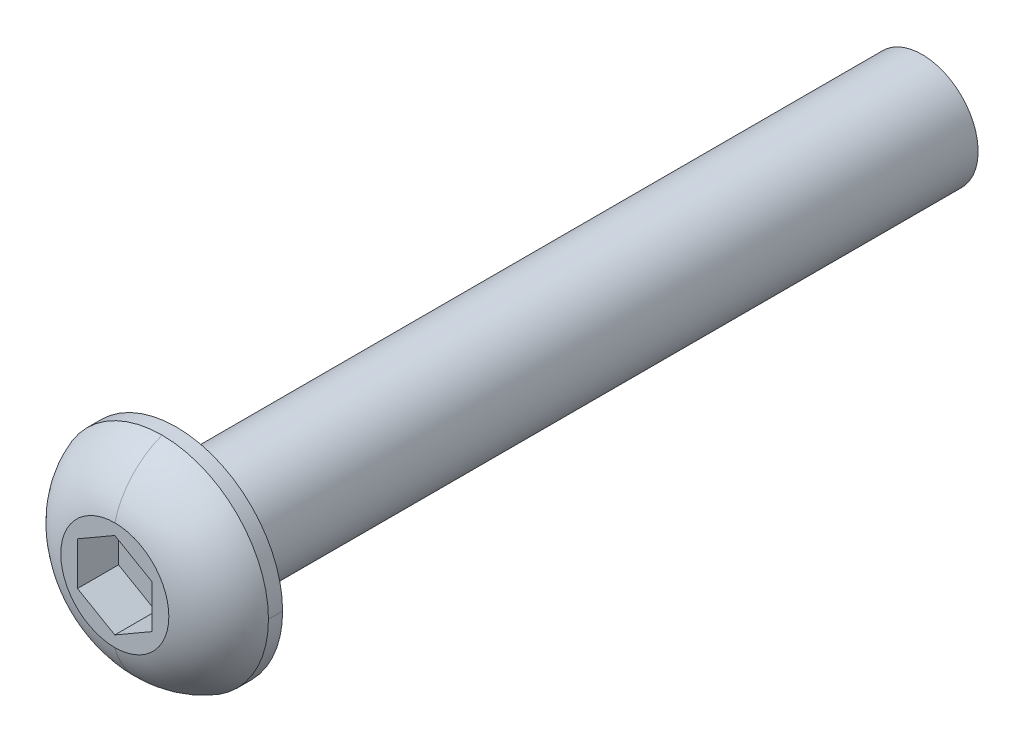
ISO-10303-21;
HEADER;
FILE_DESCRIPTION(('STEP AP214'),'2;1');
FILE_NAME('part.step','',(''),(''),'','','');
FILE_SCHEMA(('AUTOMOTIVE_DESIGN { 1 0 10303 214 1 1 1 1 }'));
ENDSEC;
DATA;
#1=APPLICATION_CONTEXT('core data for automotive mechanical design processes');
#2=APPLICATION_PROTOCOL_DEFINITION('international standard','automotive_design',2000,#1);
#3=PRODUCT_CONTEXT('',#1,'mechanical');
#4=PRODUCT('Part','Part','',(#3));
#5=PRODUCT_RELATED_PRODUCT_CATEGORY('part','',(#4));
#6=PRODUCT_DEFINITION_FORMATION('','',#4);
#7=PRODUCT_DEFINITION_CONTEXT('part definition',#1,'design');
#8=PRODUCT_DEFINITION('design','',#6,#7);
#9=PRODUCT_DEFINITION_SHAPE('','',#8);
#10=(LENGTH_UNIT() NAMED_UNIT(*) SI_UNIT(.MILLI.,.METRE.));
#11=(NAMED_UNIT(*) PLANE_ANGLE_UNIT() SI_UNIT($,.RADIAN.));
#12=(NAMED_UNIT(*) SI_UNIT($,.STERADIAN.) SOLID_ANGLE_UNIT());
#13=UNCERTAINTY_MEASURE_WITH_UNIT(LENGTH_MEASURE(1.E-05),#10,'distance_accuracy_value','');
#14=(GEOMETRIC_REPRESENTATION_CONTEXT(3) GLOBAL_UNCERTAINTY_ASSIGNED_CONTEXT((#13)) GLOBAL_UNIT_ASSIGNED_CONTEXT((#10,
#11,#12)) REPRESENTATION_CONTEXT('',''));
#15=CARTESIAN_POINT('',(0.,0.,0.));
#16=DIRECTION('',(0.,0.,1.));
#17=DIRECTION('',(1.,0.,0.));
#18=AXIS2_PLACEMENT_3D('',#15,#16,#17);
#19=CARTESIAN_POINT('',(0.,0.,0.190000000005322));
#20=DIRECTION('',(0.,0.,-1.));
#21=DIRECTION('',(-1.,0.,0.));
#22=AXIS2_PLACEMENT_3D('',#19,#20,#21);
#23=CYLINDRICAL_SURFACE('',#22,2.84999999998889);
#24=DIRECTION('',(0.,0.,-1.));
#25=VECTOR('',#24,1.);
#26=CARTESIAN_POINT('',(-2.84999999998889,0.,0.190000000005321));
#27=LINE('',#26,#25);
#28=CARTESIAN_POINT('',(-2.84999999997778,0.,0.380000000010643));
#29=VERTEX_POINT('',#28);
#30=CARTESIAN_POINT('',(-2.85,0.,0.));
#31=VERTEX_POINT('',#30);
#32=EDGE_CURVE('E200',#29,#31,#27,.T.);
#33=ORIENTED_EDGE('',*,*,#32,.F.);
#34=CARTESIAN_POINT('',(0.,0.,0.380000000010643));
#35=DIRECTION('',(0.,0.,-1.));
#36=DIRECTION('',(-1.,0.,0.));
#37=AXIS2_PLACEMENT_3D('',#34,#35,#36);
#38=CIRCLE('',#37,2.84999999997778);
#39=CARTESIAN_POINT('',(0.,2.84999999997778,0.380000000010643));
#40=VERTEX_POINT('',#39);
#41=EDGE_CURVE('E11',#29,#40,#38,.T.);
#42=ORIENTED_EDGE('',*,*,#41,.T.);
#43=CARTESIAN_POINT('',(0.,0.,0.380000000010643));
#44=DIRECTION('',(0.,0.,-1.));
#45=DIRECTION('',(-1.,0.,0.));
#46=AXIS2_PLACEMENT_3D('',#43,#44,#45);
#47=CIRCLE('',#46,2.84999999997778);
#48=CARTESIAN_POINT('',(2.84999999997778,0.,0.380000000010643));
#49=VERTEX_POINT('',#48);
#50=EDGE_CURVE('E43',#40,#49,#47,.T.);
#51=ORIENTED_EDGE('',*,*,#50,.T.);
#52=DIRECTION('',(0.,0.,1.));
#53=VECTOR('',#52,1.);
#54=CARTESIAN_POINT('',(2.84999999998889,0.,0.190000000005322));
#55=LINE('',#54,#53);
#56=CARTESIAN_POINT('',(2.85,0.,0.));
#57=VERTEX_POINT('',#56);
#58=EDGE_CURVE('E195',#57,#49,#55,.T.);
#59=ORIENTED_EDGE('',*,*,#58,.F.);
#60=CARTESIAN_POINT('',(0.,0.,0.));
#61=DIRECTION('',(0.,0.,-1.));
#62=DIRECTION('',(-1.,0.,0.));
#63=AXIS2_PLACEMENT_3D('',#60,#61,#62);
#64=CIRCLE('',#63,2.85);
#65=EDGE_CURVE('E191',#31,#57,#64,.T.);
#66=ORIENTED_EDGE('',*,*,#65,.F.);
#67=EDGE_LOOP('',(#33,#42,#51,#59,#66));
#68=FACE_BOUND('',#67,.T.);
#69=ADVANCED_FACE('F34',(#68),#23,.T.);
#70=CARTESIAN_POINT('',(0.,0.,-0.313131109201524));
#71=DIRECTION('',(0.,0.,-1.));
#72=DIRECTION('',(0.,-1.,0.));
#73=AXIS2_PLACEMENT_3D('',#70,#71,#72);
#74=DEGENERATE_TOROIDAL_SURFACE('',#73,0.945637928697733,2.02657978700265,.T.);
#75=CARTESIAN_POINT('',(0.,-0.945637928697733,-0.313131109201524));
#76=DIRECTION('',(1.,0.,0.));
#77=DIRECTION('',(0.,-1.,0.));
#78=AXIS2_PLACEMENT_3D('',#75,#76,#77);
#79=CIRCLE('',#78,2.02657978700265);
#80=CARTESIAN_POINT('',(0.,-1.44877,1.65));
#81=VERTEX_POINT('',#80);
#82=CARTESIAN_POINT('',(0.,-2.84999999997778,0.380000000010643));
#83=VERTEX_POINT('',#82);
#84=EDGE_CURVE('E169',#81,#83,#79,.T.);
#85=ORIENTED_EDGE('',*,*,#84,.F.);
#86=CARTESIAN_POINT('',(0.,0.,1.65));
#87=DIRECTION('',(0.,0.,-1.));
#88=DIRECTION('',(-1.,0.,0.));
#89=AXIS2_PLACEMENT_3D('',#86,#87,#88);
#90=CIRCLE('',#89,1.44877);
#91=CARTESIAN_POINT('',(-1.44877,0.,1.65));
#92=VERTEX_POINT('',#91);
#93=EDGE_CURVE('E184',#81,#92,#90,.T.);
#94=ORIENTED_EDGE('',*,*,#93,.T.);
#95=CARTESIAN_POINT('',(0.,0.,1.65));
#96=DIRECTION('',(0.,0.,-1.));
#97=DIRECTION('',(-1.,0.,0.));
#98=AXIS2_PLACEMENT_3D('',#95,#96,#97);
#99=CIRCLE('',#98,1.44877);
#100=CARTESIAN_POINT('',(0.,1.44877,1.65));
#101=VERTEX_POINT('',#100);
#102=EDGE_CURVE('E151',#92,#101,#99,.T.);
#103=ORIENTED_EDGE('',*,*,#102,.T.);
#104=CARTESIAN_POINT('',(0.,0.945637928697733,-0.313131109201524));
#105=DIRECTION('',(1.,0.,0.));
#106=DIRECTION('',(0.,1.,0.));
#107=AXIS2_PLACEMENT_3D('',#104,#105,#106);
#108=CIRCLE('',#107,2.02657978700265);
#109=EDGE_CURVE('E199',#40,#101,#108,.T.);
#110=ORIENTED_EDGE('',*,*,#109,.F.);
#111=ORIENTED_EDGE('',*,*,#41,.F.);
#112=CARTESIAN_POINT('',(0.,0.,0.380000000010643));
#113=DIRECTION('',(0.,0.,-1.));
#114=DIRECTION('',(-1.,0.,0.));
#115=AXIS2_PLACEMENT_3D('',#112,#113,#114);
#116=CIRCLE('',#115,2.84999999997778);
#117=EDGE_CURVE('E196',#83,#29,#116,.T.);
#118=ORIENTED_EDGE('',*,*,#117,.F.);
#119=EDGE_LOOP('',(#85,#94,#103,#110,#111,#118));
#120=FACE_BOUND('',#119,.T.);
#121=ADVANCED_FACE('F277',(#120),#74,.T.);
#122=CARTESIAN_POINT('',(0.,0.,-3.89665));
#123=DIRECTION('',(0.,0.,-1.));
#124=DIRECTION('',(-1.,0.,0.));
#125=AXIS2_PLACEMENT_3D('',#122,#123,#124);
#126=CYLINDRICAL_SURFACE('',#125,1.5);
#127=DIRECTION('',(0.,0.,1.));
#128=VECTOR('',#127,1.);
#129=CARTESIAN_POINT('',(1.5,0.,-3.89665));
#130=LINE('',#129,#128);
#131=CARTESIAN_POINT('',(1.5,0.,-7.));
#132=VERTEX_POINT('',#131);
#133=CARTESIAN_POINT('',(1.5,0.,-0.1));
#134=VERTEX_POINT('',#133);
#135=EDGE_CURVE('E50',#132,#134,#130,.T.);
#136=ORIENTED_EDGE('',*,*,#135,.F.);
#137=ORIENTED_EDGE('',*,*,#135,.T.);
#138=CARTESIAN_POINT('',(0.,0.,-0.1));
#139=DIRECTION('',(0.,0.,-1.));
#140=DIRECTION('',(-1.,0.,0.));
#141=AXIS2_PLACEMENT_3D('',#138,#139,#140);
#142=CIRCLE('',#141,1.5);
#143=CARTESIAN_POINT('',(0.,-1.5,-0.1));
#144=VERTEX_POINT('',#143);
#145=EDGE_CURVE('E154',#134,#144,#142,.T.);
#146=ORIENTED_EDGE('',*,*,#145,.T.);
#147=CARTESIAN_POINT('',(0.,0.,-0.1));
#148=DIRECTION('',(0.,0.,-1.));
#149=DIRECTION('',(-1.,0.,0.));
#150=AXIS2_PLACEMENT_3D('',#147,#148,#149);
#151=CIRCLE('',#150,1.5);
#152=CARTESIAN_POINT('',(-1.5,0.,-0.1));
#153=VERTEX_POINT('',#152);
#154=EDGE_CURVE('E148',#144,#153,#151,.T.);
#155=ORIENTED_EDGE('',*,*,#154,.T.);
#156=DIRECTION('',(0.,0.,-1.));
#157=VECTOR('',#156,1.);
#158=CARTESIAN_POINT('',(-1.5,0.,-3.89665));
#159=LINE('',#158,#157);
#160=CARTESIAN_POINT('',(-1.5,0.,-7.));
#161=VERTEX_POINT('',#160);
#162=EDGE_CURVE('E55',#153,#161,#159,.T.);
#163=ORIENTED_EDGE('',*,*,#162,.T.);
#164=ORIENTED_EDGE('',*,*,#162,.F.);
#165=CARTESIAN_POINT('',(0.,0.,-0.1));
#166=DIRECTION('',(0.,0.,-1.));
#167=DIRECTION('',(-1.,0.,0.));
#168=AXIS2_PLACEMENT_3D('',#165,#166,#167);
#169=CIRCLE('',#168,1.5);
#170=CARTESIAN_POINT('',(0.,1.5,-0.1));
#171=VERTEX_POINT('',#170);
#172=EDGE_CURVE('E141',#153,#171,#169,.T.);
#173=ORIENTED_EDGE('',*,*,#172,.T.);
#174=CARTESIAN_POINT('',(0.,0.,-0.1));
#175=DIRECTION('',(0.,0.,-1.));
#176=DIRECTION('',(-1.,0.,0.));
#177=AXIS2_PLACEMENT_3D('',#174,#175,#176);
#178=CIRCLE('',#177,1.5);
#179=EDGE_CURVE('E38',#171,#134,#178,.T.);
#180=ORIENTED_EDGE('',*,*,#179,.T.);
#181=EDGE_LOOP('',(#136,#137,#146,#155,#163,#164,#173,#180));
#182=FACE_BOUND('',#181,.T.);
#183=CARTESIAN_POINT('',(0.,0.,-20.));
#184=DIRECTION('',(0.,0.,-1.));
#185=DIRECTION('',(-1.,0.,0.));
#186=AXIS2_PLACEMENT_3D('',#183,#184,#185);
#187=CIRCLE('',#186,1.5);
#188=CARTESIAN_POINT('',(-1.5,0.,-20.));
#189=VERTEX_POINT('',#188);
#190=EDGE_CURVE('E230',#189,#189,#187,.T.);
#191=ORIENTED_EDGE('',*,*,#190,.F.);
#192=EDGE_LOOP('',(#191));
#193=FACE_BOUND('',#192,.T.);
#194=ADVANCED_FACE('F139',(#182,#193),#126,.T.);
#195=CARTESIAN_POINT('',(0.,0.,-0.1));
#196=DIRECTION('',(0.,0.,-1.));
#197=DIRECTION('',(0.,-1.,0.));
#198=AXIS2_PLACEMENT_3D('',#195,#196,#197);
#199=TOROIDAL_SURFACE('',#198,1.6,0.1);
#200=CARTESIAN_POINT('',(0.,1.6,-0.1));
#201=DIRECTION('',(1.,0.,0.));
#202=DIRECTION('',(0.,1.,0.));
#203=AXIS2_PLACEMENT_3D('',#200,#201,#202);
#204=CIRCLE('',#203,0.1);
#205=CARTESIAN_POINT('',(0.,1.6,0.));
#206=VERTEX_POINT('',#205);
#207=EDGE_CURVE('E150',#206,#171,#204,.T.);
#208=ORIENTED_EDGE('',*,*,#207,.F.);
#209=CARTESIAN_POINT('',(0.,0.,0.));
#210=DIRECTION('',(0.,0.,-1.));
#211=DIRECTION('',(-1.,0.,0.));
#212=AXIS2_PLACEMENT_3D('',#209,#210,#211);
#213=CIRCLE('',#212,1.6);
#214=CARTESIAN_POINT('',(0.,-1.6,0.));
#215=VERTEX_POINT('',#214);
#216=EDGE_CURVE('E235',#206,#215,#213,.T.);
#217=ORIENTED_EDGE('',*,*,#216,.T.);
#218=CARTESIAN_POINT('',(0.,-1.6,-0.1));
#219=DIRECTION('',(1.,0.,0.));
#220=DIRECTION('',(0.,-1.,0.));
#221=AXIS2_PLACEMENT_3D('',#218,#219,#220);
#222=CIRCLE('',#221,0.1);
#223=EDGE_CURVE('E224',#144,#215,#222,.T.);
#224=ORIENTED_EDGE('',*,*,#223,.F.);
#225=ORIENTED_EDGE('',*,*,#145,.F.);
#226=ORIENTED_EDGE('',*,*,#179,.F.);
#227=EDGE_LOOP('',(#208,#217,#224,#225,#226));
#228=FACE_BOUND('',#227,.T.);
#229=ADVANCED_FACE('F276',(#228),#199,.F.);
#230=CARTESIAN_POINT('',(1.,0.2886751346,1.65));
#231=DIRECTION('',(1.,0.,0.));
#232=DIRECTION('',(0.,1.,0.));
#233=AXIS2_PLACEMENT_3D('',#230,#231,#232);
#234=PLANE('',#233);
#235=DIRECTION('',(0.,1.,0.));
#236=VECTOR('',#235,1.);
#237=CARTESIAN_POINT('',(1.,0.,0.55));
#238=LINE('',#237,#236);
#239=CARTESIAN_POINT('',(1.,-0.5773502692,0.55));
#240=VERTEX_POINT('',#239);
#241=CARTESIAN_POINT('',(1.,0.5773502692,0.55));
#242=VERTEX_POINT('',#241);
#243=EDGE_CURVE('E172',#240,#242,#238,.T.);
#244=ORIENTED_EDGE('',*,*,#243,.F.);
#245=DIRECTION('',(0.,0.,-1.));
#246=VECTOR('',#245,1.);
#247=CARTESIAN_POINT('',(1.,-0.5773502692,1.65));
#248=LINE('',#247,#246);
#249=CARTESIAN_POINT('',(1.,-0.5773502692,1.65));
#250=VERTEX_POINT('',#249);
#251=EDGE_CURVE('E181',#250,#240,#248,.T.);
#252=ORIENTED_EDGE('',*,*,#251,.F.);
#253=DIRECTION('',(0.,-1.,0.));
#254=VECTOR('',#253,1.);
#255=CARTESIAN_POINT('',(1.,0.1443375673,1.65));
#256=LINE('',#255,#254);
#257=CARTESIAN_POINT('',(1.,0.5773502692,1.65));
#258=VERTEX_POINT('',#257);
#259=EDGE_CURVE('E156',#258,#250,#256,.T.);
#260=ORIENTED_EDGE('',*,*,#259,.F.);
#261=DIRECTION('',(0.,0.,-1.));
#262=VECTOR('',#261,1.);
#263=CARTESIAN_POINT('',(1.,0.5773502692,1.65));
#264=LINE('',#263,#262);
#265=EDGE_CURVE('E232',#258,#242,#264,.T.);
#266=ORIENTED_EDGE('',*,*,#265,.T.);
#267=EDGE_LOOP('',(#244,#252,#260,#266));
#268=FACE_BOUND('',#267,.T.);
#269=ADVANCED_FACE('F36',(#268),#234,.F.);
#270=CARTESIAN_POINT('',(0.5,0.8660254038,1.65));
#271=DIRECTION('',(0.500000000006738,0.866025403780548,0.));
#272=DIRECTION('',(0.,0.,-1.));
#273=AXIS2_PLACEMENT_3D('',#270,#271,#272);
#274=PLANE('',#273);
#275=DIRECTION('',(-0.866025403780548,0.500000000006738,0.));
#276=VECTOR('',#275,1.);
#277=CARTESIAN_POINT('',(0.,1.1547005384,0.55));
#278=LINE('',#277,#276);
#279=CARTESIAN_POINT('',(0.,1.1547005384,0.55));
#280=VERTEX_POINT('',#279);
#281=EDGE_CURVE('E170',#242,#280,#278,.T.);
#282=ORIENTED_EDGE('',*,*,#281,.F.);
#283=ORIENTED_EDGE('',*,*,#265,.F.);
#284=DIRECTION('',(0.866025403780548,-0.500000000006738,0.));
#285=VECTOR('',#284,1.);
#286=CARTESIAN_POINT('',(0.0127306250111162,1.14735050862275,1.65));
#287=LINE('',#286,#285);
#288=CARTESIAN_POINT('',(0.,1.1547005384,1.65));
#289=VERTEX_POINT('',#288);
#290=EDGE_CURVE('E165',#289,#258,#287,.T.);
#291=ORIENTED_EDGE('',*,*,#290,.F.);
#292=DIRECTION('',(0.,0.,-1.));
#293=VECTOR('',#292,1.);
#294=CARTESIAN_POINT('',(0.,1.1547005384,1.65));
#295=LINE('',#294,#293);
#296=EDGE_CURVE('E213',#289,#280,#295,.T.);
#297=ORIENTED_EDGE('',*,*,#296,.T.);
#298=EDGE_LOOP('',(#282,#283,#291,#297));
#299=FACE_BOUND('',#298,.T.);
#300=ADVANCED_FACE('F327',(#299),#274,.F.);
#301=CARTESIAN_POINT('',(-0.5,0.8660254038,1.65));
#302=DIRECTION('',(-0.500000000006738,0.866025403780548,0.));
#303=DIRECTION('',(0.,0.,1.));
#304=AXIS2_PLACEMENT_3D('',#301,#302,#303);
#305=PLANE('',#304);
#306=DIRECTION('',(-0.866025403780548,-0.500000000006738,0.));
#307=VECTOR('',#306,1.);
#308=CARTESIAN_POINT('',(-1.,0.5773502692,0.55));
#309=LINE('',#308,#307);
#310=CARTESIAN_POINT('',(-1.,0.5773502692,0.55));
#311=VERTEX_POINT('',#310);
#312=EDGE_CURVE('E173',#280,#311,#309,.T.);
#313=ORIENTED_EDGE('',*,*,#312,.F.);
#314=ORIENTED_EDGE('',*,*,#296,.F.);
#315=DIRECTION('',(0.866025403780548,0.500000000006738,0.));
#316=VECTOR('',#315,1.);
#317=CARTESIAN_POINT('',(-0.98726937500236,0.584700298969471,1.65));
#318=LINE('',#317,#316);
#319=CARTESIAN_POINT('',(-1.,0.5773502692,1.65));
#320=VERTEX_POINT('',#319);
#321=EDGE_CURVE('E168',#320,#289,#318,.T.);
#322=ORIENTED_EDGE('',*,*,#321,.F.);
#323=DIRECTION('',(0.,0.,-1.));
#324=VECTOR('',#323,1.);
#325=CARTESIAN_POINT('',(-1.,0.5773502692,1.65));
#326=LINE('',#325,#324);
#327=EDGE_CURVE('E215',#320,#311,#326,.T.);
#328=ORIENTED_EDGE('',*,*,#327,.T.);
#329=EDGE_LOOP('',(#313,#314,#322,#328));
#330=FACE_BOUND('',#329,.T.);
#331=ADVANCED_FACE('F324',(#330),#305,.F.);
#332=CARTESIAN_POINT('',(-1.,0.,1.65));
#333=DIRECTION('',(-1.,0.,0.));
#334=DIRECTION('',(0.,0.,1.));
#335=AXIS2_PLACEMENT_3D('',#332,#333,#334);
#336=PLANE('',#335);
#337=DIRECTION('',(0.,-1.,0.));
#338=VECTOR('',#337,1.);
#339=CARTESIAN_POINT('',(-1.,-0.5773502692,0.55));
#340=LINE('',#339,#338);
#341=CARTESIAN_POINT('',(-1.,-0.5773502692,0.55));
#342=VERTEX_POINT('',#341);
#343=EDGE_CURVE('E174',#311,#342,#340,.T.);
#344=ORIENTED_EDGE('',*,*,#343,.F.);
#345=ORIENTED_EDGE('',*,*,#327,.F.);
#346=DIRECTION('',(0.,1.,0.));
#347=VECTOR('',#346,1.);
#348=CARTESIAN_POINT('',(-1.,0.,1.65));
#349=LINE('',#348,#347);
#350=CARTESIAN_POINT('',(-1.,-0.5773502692,1.65));
#351=VERTEX_POINT('',#350);
#352=EDGE_CURVE('E185',#351,#320,#349,.T.);
#353=ORIENTED_EDGE('',*,*,#352,.F.);
#354=DIRECTION('',(0.,0.,-1.));
#355=VECTOR('',#354,1.);
#356=CARTESIAN_POINT('',(-1.,-0.5773502692,1.65));
#357=LINE('',#356,#355);
#358=EDGE_CURVE('E180',#351,#342,#357,.T.);
#359=ORIENTED_EDGE('',*,*,#358,.T.);
#360=EDGE_LOOP('',(#344,#345,#353,#359));
#361=FACE_BOUND('',#360,.T.);
#362=ADVANCED_FACE('F262',(#361),#336,.F.);
#363=CARTESIAN_POINT('',(-0.5,-0.8660254038,1.65));
#364=DIRECTION('',(-0.500000000006738,-0.866025403780548,0.));
#365=DIRECTION('',(-0.866025403780548,0.500000000006738,0.));
#366=AXIS2_PLACEMENT_3D('',#363,#364,#365);
#367=PLANE('',#366);
#368=DIRECTION('',(0.866025403780548,-0.500000000006738,0.));
#369=VECTOR('',#368,1.);
#370=CARTESIAN_POINT('',(0.,-1.1547005384,0.55));
#371=LINE('',#370,#369);
#372=CARTESIAN_POINT('',(0.,-1.1547005384,0.55));
#373=VERTEX_POINT('',#372);
#374=EDGE_CURVE('E176',#342,#373,#371,.T.);
#375=ORIENTED_EDGE('',*,*,#374,.F.);
#376=ORIENTED_EDGE('',*,*,#358,.F.);
#377=DIRECTION('',(-0.866025403780548,0.500000000006738,0.));
#378=VECTOR('',#377,1.);
#379=CARTESIAN_POINT('',(-0.98726937500236,-0.584700298969471,1.65));
#380=LINE('',#379,#378);
#381=CARTESIAN_POINT('',(0.,-1.1547005384,1.65));
#382=VERTEX_POINT('',#381);
#383=EDGE_CURVE('E163',#382,#351,#380,.T.);
#384=ORIENTED_EDGE('',*,*,#383,.F.);
#385=DIRECTION('',(0.,0.,-1.));
#386=VECTOR('',#385,1.);
#387=CARTESIAN_POINT('',(0.,-1.1547005384,1.65));
#388=LINE('',#387,#386);
#389=EDGE_CURVE('E177',#382,#373,#388,.T.);
#390=ORIENTED_EDGE('',*,*,#389,.T.);
#391=EDGE_LOOP('',(#375,#376,#384,#390));
#392=FACE_BOUND('',#391,.T.);
#393=ADVANCED_FACE('F249',(#392),#367,.F.);
#394=CARTESIAN_POINT('',(0.5,-0.8660254038,1.65));
#395=DIRECTION('',(0.500000000006738,-0.866025403780548,0.));
#396=DIRECTION('',(0.,0.,-1.));
#397=AXIS2_PLACEMENT_3D('',#394,#395,#396);
#398=PLANE('',#397);
#399=DIRECTION('',(0.866025403780548,0.500000000006738,0.));
#400=VECTOR('',#399,1.);
#401=CARTESIAN_POINT('',(1.,-0.5773502692,0.55));
#402=LINE('',#401,#400);
#403=EDGE_CURVE('E218',#373,#240,#402,.T.);
#404=ORIENTED_EDGE('',*,*,#403,.F.);
#405=ORIENTED_EDGE('',*,*,#389,.F.);
#406=DIRECTION('',(-0.866025403780548,-0.500000000006738,0.));
#407=VECTOR('',#406,1.);
#408=CARTESIAN_POINT('',(0.0127306250111161,-1.14735050862275,1.65));
#409=LINE('',#408,#407);
#410=EDGE_CURVE('E159',#250,#382,#409,.T.);
#411=ORIENTED_EDGE('',*,*,#410,.F.);
#412=ORIENTED_EDGE('',*,*,#251,.T.);
#413=EDGE_LOOP('',(#404,#405,#411,#412));
#414=FACE_BOUND('',#413,.T.);
#415=ADVANCED_FACE('F253',(#414),#398,.F.);
#416=CARTESIAN_POINT('',(0.,0.,0.55));
#417=DIRECTION('',(0.,0.,-1.));
#418=DIRECTION('',(0.,-1.,0.));
#419=AXIS2_PLACEMENT_3D('',#416,#417,#418);
#420=PLANE('',#419);
#421=ORIENTED_EDGE('',*,*,#243,.T.);
#422=ORIENTED_EDGE('',*,*,#281,.T.);
#423=ORIENTED_EDGE('',*,*,#312,.T.);
#424=ORIENTED_EDGE('',*,*,#343,.T.);
#425=ORIENTED_EDGE('',*,*,#374,.T.);
#426=ORIENTED_EDGE('',*,*,#403,.T.);
#427=EDGE_LOOP('',(#421,#422,#423,#424,#425,#426));
#428=FACE_BOUND('',#427,.T.);
#429=ADVANCED_FACE('F257',(#428),#420,.F.);
#430=CARTESIAN_POINT('',(-2.225,0.,0.));
#431=DIRECTION('',(0.,0.,-1.));
#432=DIRECTION('',(0.,-1.,0.));
#433=AXIS2_PLACEMENT_3D('',#430,#431,#432);
#434=PLANE('',#433);
#435=ORIENTED_EDGE('',*,*,#65,.T.);
#436=CARTESIAN_POINT('',(0.,0.,0.));
#437=DIRECTION('',(0.,0.,-1.));
#438=DIRECTION('',(-1.,0.,0.));
#439=AXIS2_PLACEMENT_3D('',#436,#437,#438);
#440=CIRCLE('',#439,2.85);
#441=EDGE_CURVE('E188',#57,#31,#440,.T.);
#442=ORIENTED_EDGE('',*,*,#441,.T.);
#443=EDGE_LOOP('',(#435,#442));
#444=FACE_BOUND('',#443,.T.);
#445=CARTESIAN_POINT('',(0.,0.,0.));
#446=DIRECTION('',(0.,0.,-1.));
#447=DIRECTION('',(-1.,0.,0.));
#448=AXIS2_PLACEMENT_3D('',#445,#446,#447);
#449=CIRCLE('',#448,1.6);
#450=CARTESIAN_POINT('',(-1.6,0.,0.));
#451=VERTEX_POINT('',#450);
#452=EDGE_CURVE('E143',#451,#206,#449,.T.);
#453=ORIENTED_EDGE('',*,*,#452,.F.);
#454=CARTESIAN_POINT('',(0.,0.,0.));
#455=DIRECTION('',(0.,0.,-1.));
#456=DIRECTION('',(-1.,0.,0.));
#457=AXIS2_PLACEMENT_3D('',#454,#455,#456);
#458=CIRCLE('',#457,1.6);
#459=EDGE_CURVE('E221',#215,#451,#458,.T.);
#460=ORIENTED_EDGE('',*,*,#459,.F.);
#461=ORIENTED_EDGE('',*,*,#216,.F.);
#462=EDGE_LOOP('',(#453,#460,#461));
#463=FACE_BOUND('',#462,.T.);
#464=ADVANCED_FACE('F301',(#444,#463),#434,.T.);
#465=CARTESIAN_POINT('',(0.,0.,-0.1));
#466=DIRECTION('',(0.,0.,-1.));
#467=DIRECTION('',(0.,-1.,0.));
#468=AXIS2_PLACEMENT_3D('',#465,#466,#467);
#469=TOROIDAL_SURFACE('',#468,1.6,0.1);
#470=ORIENTED_EDGE('',*,*,#207,.T.);
#471=ORIENTED_EDGE('',*,*,#172,.F.);
#472=ORIENTED_EDGE('',*,*,#154,.F.);
#473=ORIENTED_EDGE('',*,*,#223,.T.);
#474=ORIENTED_EDGE('',*,*,#459,.T.);
#475=ORIENTED_EDGE('',*,*,#452,.T.);
#476=EDGE_LOOP('',(#470,#471,#472,#473,#474,#475));
#477=FACE_BOUND('',#476,.T.);
#478=ADVANCED_FACE('F147',(#477),#469,.F.);
#479=CARTESIAN_POINT('',(-1.299385,0.,1.65));
#480=DIRECTION('',(0.,0.,1.));
#481=DIRECTION('',(1.,0.,0.));
#482=AXIS2_PLACEMENT_3D('',#479,#480,#481);
#483=PLANE('',#482);
#484=ORIENTED_EDGE('',*,*,#102,.F.);
#485=ORIENTED_EDGE('',*,*,#93,.F.);
#486=CARTESIAN_POINT('',(0.,0.,1.65));
#487=DIRECTION('',(0.,0.,-1.));
#488=DIRECTION('',(-1.,0.,0.));
#489=AXIS2_PLACEMENT_3D('',#486,#487,#488);
#490=CIRCLE('',#489,1.44877);
#491=EDGE_CURVE('E197',#101,#81,#490,.T.);
#492=ORIENTED_EDGE('',*,*,#491,.F.);
#493=EDGE_LOOP('',(#484,#485,#492));
#494=FACE_BOUND('',#493,.T.);
#495=ORIENTED_EDGE('',*,*,#259,.T.);
#496=ORIENTED_EDGE('',*,*,#410,.T.);
#497=ORIENTED_EDGE('',*,*,#383,.T.);
#498=ORIENTED_EDGE('',*,*,#352,.T.);
#499=ORIENTED_EDGE('',*,*,#321,.T.);
#500=ORIENTED_EDGE('',*,*,#290,.T.);
#501=EDGE_LOOP('',(#495,#496,#497,#498,#499,#500));
#502=FACE_BOUND('',#501,.T.);
#503=ADVANCED_FACE('F244',(#494,#502),#483,.T.);
#504=CARTESIAN_POINT('',(0.,0.,-0.313131109201524));
#505=DIRECTION('',(0.,0.,-1.));
#506=DIRECTION('',(0.,-1.,0.));
#507=AXIS2_PLACEMENT_3D('',#504,#505,#506);
#508=DEGENERATE_TOROIDAL_SURFACE('',#507,0.945637928697733,2.02657978700265,.T.);
#509=ORIENTED_EDGE('',*,*,#84,.T.);
#510=CARTESIAN_POINT('',(0.,0.,0.380000000010643));
#511=DIRECTION('',(0.,0.,-1.));
#512=DIRECTION('',(-1.,0.,0.));
#513=AXIS2_PLACEMENT_3D('',#510,#511,#512);
#514=CIRCLE('',#513,2.84999999997778);
#515=EDGE_CURVE('E193',#49,#83,#514,.T.);
#516=ORIENTED_EDGE('',*,*,#515,.F.);
#517=ORIENTED_EDGE('',*,*,#50,.F.);
#518=ORIENTED_EDGE('',*,*,#109,.T.);
#519=ORIENTED_EDGE('',*,*,#491,.T.);
#520=EDGE_LOOP('',(#509,#516,#517,#518,#519));
#521=FACE_BOUND('',#520,.T.);
#522=ADVANCED_FACE('F303',(#521),#508,.T.);
#523=CARTESIAN_POINT('',(0.,0.,0.190000000005322));
#524=DIRECTION('',(0.,0.,-1.));
#525=DIRECTION('',(-1.,0.,0.));
#526=AXIS2_PLACEMENT_3D('',#523,#524,#525);
#527=CYLINDRICAL_SURFACE('',#526,2.84999999998889);
#528=ORIENTED_EDGE('',*,*,#32,.T.);
#529=ORIENTED_EDGE('',*,*,#441,.F.);
#530=ORIENTED_EDGE('',*,*,#58,.T.);
#531=ORIENTED_EDGE('',*,*,#515,.T.);
#532=ORIENTED_EDGE('',*,*,#117,.T.);
#533=EDGE_LOOP('',(#528,#529,#530,#531,#532));
#534=FACE_BOUND('',#533,.T.);
#535=ADVANCED_FACE('F295',(#534),#527,.T.);
#536=CARTESIAN_POINT('',(0.,0.,-20.));
#537=DIRECTION('',(0.,0.,-1.));
#538=DIRECTION('',(-1.,0.,0.));
#539=AXIS2_PLACEMENT_3D('',#536,#537,#538);
#540=PLANE('',#539);
#541=ORIENTED_EDGE('',*,*,#190,.T.);
#542=EDGE_LOOP('',(#541));
#543=FACE_BOUND('',#542,.T.);
#544=ADVANCED_FACE('F274',(#543),#540,.T.);
#545=CLOSED_SHELL('',(#69,#121,#194,#229,#269,#300,#331,#362,#393,#415,#429,#464,#478,#503,#522,
#535,#544));
#546=MANIFOLD_SOLID_BREP('B2',#545);
#547=ADVANCED_BREP_SHAPE_REPRESENTATION('',(#18,#546),#14);
#548=SHAPE_DEFINITION_REPRESENTATION(#9,#547);
ENDSEC;
END-ISO-10303-21;
